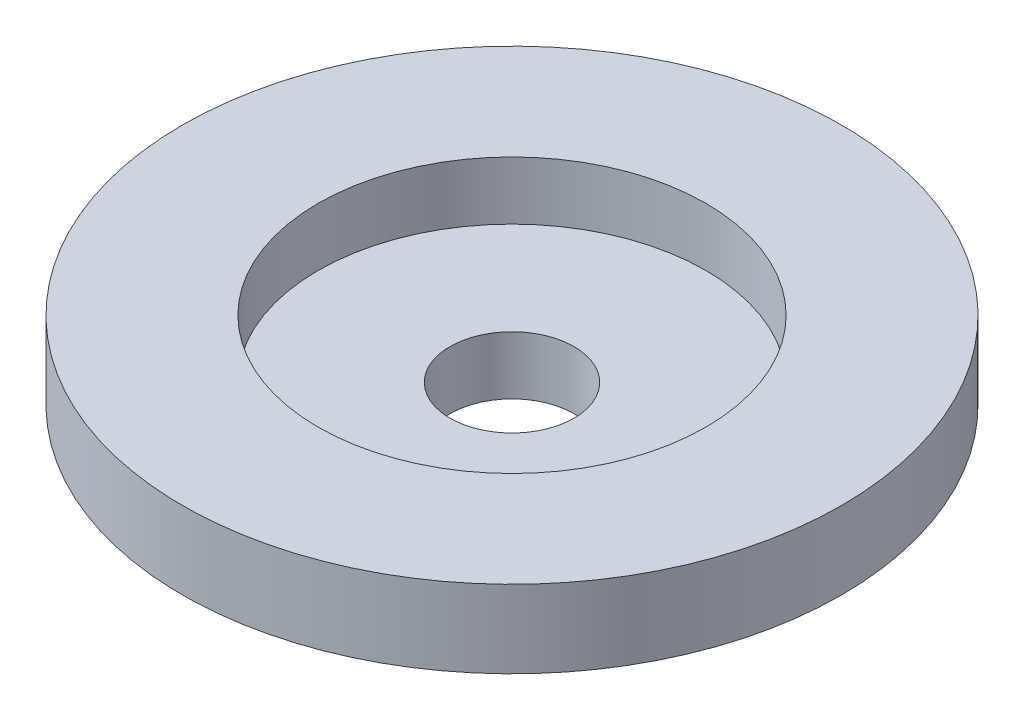
ISO-10303-21;
HEADER;
FILE_DESCRIPTION(('STEP AP214'),'2;1');
FILE_NAME('part.step','',(''),(''),'','','');
FILE_SCHEMA(('AUTOMOTIVE_DESIGN { 1 0 10303 214 1 1 1 1 }'));
ENDSEC;
DATA;
#1=APPLICATION_CONTEXT('core data for automotive mechanical design processes');
#2=APPLICATION_PROTOCOL_DEFINITION('international standard','automotive_design',2000,#1);
#3=PRODUCT_CONTEXT('',#1,'mechanical');
#4=PRODUCT('Part','Part','',(#3));
#5=PRODUCT_RELATED_PRODUCT_CATEGORY('part','',(#4));
#6=PRODUCT_DEFINITION_FORMATION('','',#4);
#7=PRODUCT_DEFINITION_CONTEXT('part definition',#1,'design');
#8=PRODUCT_DEFINITION('design','',#6,#7);
#9=PRODUCT_DEFINITION_SHAPE('','',#8);
#10=(LENGTH_UNIT() NAMED_UNIT(*) SI_UNIT(.MILLI.,.METRE.));
#11=(NAMED_UNIT(*) PLANE_ANGLE_UNIT() SI_UNIT($,.RADIAN.));
#12=(NAMED_UNIT(*) SI_UNIT($,.STERADIAN.) SOLID_ANGLE_UNIT());
#13=UNCERTAINTY_MEASURE_WITH_UNIT(LENGTH_MEASURE(1.E-05),#10,'distance_accuracy_value','');
#14=(GEOMETRIC_REPRESENTATION_CONTEXT(3) GLOBAL_UNCERTAINTY_ASSIGNED_CONTEXT((#13)) GLOBAL_UNIT_ASSIGNED_CONTEXT((#10,
#11,#12)) REPRESENTATION_CONTEXT('',''));
#15=CARTESIAN_POINT('',(0.,0.,0.));
#16=DIRECTION('',(0.,0.,1.));
#17=DIRECTION('',(1.,0.,0.));
#18=AXIS2_PLACEMENT_3D('',#15,#16,#17);
#19=CARTESIAN_POINT('',(3.49148133884313E-12,-1000.,0.));
#20=DIRECTION('',(0.,-1.,0.));
#21=DIRECTION('',(1.,0.,0.));
#22=AXIS2_PLACEMENT_3D('',#19,#20,#21);
#23=CYLINDRICAL_SURFACE('',#22,1.6);
#24=CARTESIAN_POINT('',(0.,1.50000000000006,0.));
#25=DIRECTION('',(0.,-1.,0.));
#26=DIRECTION('',(1.,0.,0.));
#27=AXIS2_PLACEMENT_3D('',#24,#25,#26);
#28=CIRCLE('',#27,1.59999999999999);
#29=CARTESIAN_POINT('',(1.59999999999999,1.50000000000006,0.));
#30=VERTEX_POINT('',#29);
#31=EDGE_CURVE('E59',#30,#30,#28,.T.);
#32=ORIENTED_EDGE('',*,*,#31,.F.);
#33=EDGE_LOOP('',(#32));
#34=FACE_BOUND('',#33,.T.);
#35=CARTESIAN_POINT('',(0.,0.,0.));
#36=DIRECTION('',(0.,-1.,0.));
#37=DIRECTION('',(1.,0.,0.));
#38=AXIS2_PLACEMENT_3D('',#35,#36,#37);
#39=CIRCLE('',#38,1.6);
#40=CARTESIAN_POINT('',(1.6,0.,0.));
#41=VERTEX_POINT('',#40);
#42=EDGE_CURVE('E10',#41,#41,#39,.T.);
#43=ORIENTED_EDGE('',*,*,#42,.T.);
#44=EDGE_LOOP('',(#43));
#45=FACE_BOUND('',#44,.T.);
#46=ADVANCED_FACE('F31',(#34,#45),#23,.F.);
#47=CARTESIAN_POINT('',(-1.6,0.,0.));
#48=DIRECTION('',(0.,1.,0.));
#49=DIRECTION('',(-1.,0.,0.));
#50=AXIS2_PLACEMENT_3D('',#47,#48,#49);
#51=PLANE('',#50);
#52=ORIENTED_EDGE('',*,*,#42,.F.);
#53=EDGE_LOOP('',(#52));
#54=FACE_BOUND('',#53,.T.);
#55=CARTESIAN_POINT('',(0.,0.,0.));
#56=DIRECTION('',(0.,-1.,0.));
#57=DIRECTION('',(1.,0.,0.));
#58=AXIS2_PLACEMENT_3D('',#55,#56,#57);
#59=CIRCLE('',#58,6.5);
#60=CARTESIAN_POINT('',(6.5,0.,0.));
#61=VERTEX_POINT('',#60);
#62=EDGE_CURVE('E37',#61,#61,#59,.T.);
#63=ORIENTED_EDGE('',*,*,#62,.T.);
#64=EDGE_LOOP('',(#63));
#65=FACE_BOUND('',#64,.T.);
#66=ADVANCED_FACE('F66',(#54,#65),#51,.F.);
#67=CARTESIAN_POINT('',(3.49148133884313E-12,-1000.,0.));
#68=DIRECTION('',(0.,-1.,0.));
#69=DIRECTION('',(1.,0.,0.));
#70=AXIS2_PLACEMENT_3D('',#67,#68,#69);
#71=CYLINDRICAL_SURFACE('',#70,6.5);
#72=ORIENTED_EDGE('',*,*,#62,.F.);
#73=EDGE_LOOP('',(#72));
#74=FACE_BOUND('',#73,.T.);
#75=CARTESIAN_POINT('',(0.,0.99999999999989,0.));
#76=DIRECTION('',(0.,-1.,0.));
#77=DIRECTION('',(1.,0.,0.));
#78=AXIS2_PLACEMENT_3D('',#75,#76,#77);
#79=CIRCLE('',#78,6.5);
#80=CARTESIAN_POINT('',(6.49999999999999,0.999999999999913,0.));
#81=VERTEX_POINT('',#80);
#82=EDGE_CURVE('E41',#81,#81,#79,.T.);
#83=ORIENTED_EDGE('',*,*,#82,.T.);
#84=EDGE_LOOP('',(#83));
#85=FACE_BOUND('',#84,.T.);
#86=ADVANCED_FACE('F70',(#74,#85),#71,.T.);
#87=CARTESIAN_POINT('',(-6.5,1.,0.));
#88=DIRECTION('',(0.,1.,0.));
#89=DIRECTION('',(-1.,0.,0.));
#90=AXIS2_PLACEMENT_3D('',#87,#88,#89);
#91=PLANE('',#90);
#92=ORIENTED_EDGE('',*,*,#82,.F.);
#93=EDGE_LOOP('',(#92));
#94=FACE_BOUND('',#93,.T.);
#95=CARTESIAN_POINT('',(0.,0.99999999999989,0.));
#96=DIRECTION('',(0.,-1.,0.));
#97=DIRECTION('',(1.,0.,0.));
#98=AXIS2_PLACEMENT_3D('',#95,#96,#97);
#99=CIRCLE('',#98,8.5);
#100=CARTESIAN_POINT('',(8.49999999999999,0.99999999999992,0.));
#101=VERTEX_POINT('',#100);
#102=EDGE_CURVE('E45',#101,#101,#99,.T.);
#103=ORIENTED_EDGE('',*,*,#102,.T.);
#104=EDGE_LOOP('',(#103));
#105=FACE_BOUND('',#104,.T.);
#106=ADVANCED_FACE('F75',(#94,#105),#91,.F.);
#107=CARTESIAN_POINT('',(3.49148133884313E-12,-1000.,0.));
#108=DIRECTION('',(0.,-1.,0.));
#109=DIRECTION('',(1.,0.,0.));
#110=AXIS2_PLACEMENT_3D('',#107,#108,#109);
#111=CYLINDRICAL_SURFACE('',#110,8.49999999999999);
#112=ORIENTED_EDGE('',*,*,#102,.F.);
#113=EDGE_LOOP('',(#112));
#114=FACE_BOUND('',#113,.T.);
#115=CARTESIAN_POINT('',(0.,2.99999999999989,0.));
#116=DIRECTION('',(0.,-1.,0.));
#117=DIRECTION('',(1.,0.,0.));
#118=AXIS2_PLACEMENT_3D('',#115,#116,#117);
#119=CIRCLE('',#118,8.49999999999999);
#120=CARTESIAN_POINT('',(8.49999999999998,2.99999999999992,0.));
#121=VERTEX_POINT('',#120);
#122=EDGE_CURVE('E50',#121,#121,#119,.T.);
#123=ORIENTED_EDGE('',*,*,#122,.T.);
#124=EDGE_LOOP('',(#123));
#125=FACE_BOUND('',#124,.T.);
#126=ADVANCED_FACE('F81',(#114,#125),#111,.T.);
#127=CARTESIAN_POINT('',(-8.5,2.99999999999999,0.));
#128=DIRECTION('',(0.,-1.,0.));
#129=DIRECTION('',(1.,0.,0.));
#130=AXIS2_PLACEMENT_3D('',#127,#128,#129);
#131=PLANE('',#130);
#132=ORIENTED_EDGE('',*,*,#122,.F.);
#133=EDGE_LOOP('',(#132));
#134=FACE_BOUND('',#133,.T.);
#135=CARTESIAN_POINT('',(0.,2.99999999999989,0.));
#136=DIRECTION('',(0.,-1.,0.));
#137=DIRECTION('',(1.,0.,0.));
#138=AXIS2_PLACEMENT_3D('',#135,#136,#137);
#139=CIRCLE('',#138,4.99999999999999);
#140=CARTESIAN_POINT('',(4.99999999999998,2.99999999999991,0.));
#141=VERTEX_POINT('',#140);
#142=EDGE_CURVE('E53',#141,#141,#139,.T.);
#143=ORIENTED_EDGE('',*,*,#142,.T.);
#144=EDGE_LOOP('',(#143));
#145=FACE_BOUND('',#144,.T.);
#146=ADVANCED_FACE('F85',(#134,#145),#131,.F.);
#147=CARTESIAN_POINT('',(3.49148133884313E-12,-1000.,0.));
#148=DIRECTION('',(0.,-1.,0.));
#149=DIRECTION('',(1.,0.,0.));
#150=AXIS2_PLACEMENT_3D('',#147,#148,#149);
#151=CYLINDRICAL_SURFACE('',#150,4.99999999999999);
#152=ORIENTED_EDGE('',*,*,#142,.F.);
#153=EDGE_LOOP('',(#152));
#154=FACE_BOUND('',#153,.T.);
#155=CARTESIAN_POINT('',(0.,1.50000000000006,0.));
#156=DIRECTION('',(0.,-1.,0.));
#157=DIRECTION('',(1.,0.,0.));
#158=AXIS2_PLACEMENT_3D('',#155,#156,#157);
#159=CIRCLE('',#158,5.);
#160=CARTESIAN_POINT('',(4.99999999999999,1.50000000000007,0.));
#161=VERTEX_POINT('',#160);
#162=EDGE_CURVE('E56',#161,#161,#159,.T.);
#163=ORIENTED_EDGE('',*,*,#162,.T.);
#164=EDGE_LOOP('',(#163));
#165=FACE_BOUND('',#164,.T.);
#166=ADVANCED_FACE('F89',(#154,#165),#151,.F.);
#167=CARTESIAN_POINT('',(-5.,1.49999999999999,0.));
#168=DIRECTION('',(0.,-1.,0.));
#169=DIRECTION('',(1.,0.,0.));
#170=AXIS2_PLACEMENT_3D('',#167,#168,#169);
#171=PLANE('',#170);
#172=ORIENTED_EDGE('',*,*,#162,.F.);
#173=EDGE_LOOP('',(#172));
#174=FACE_BOUND('',#173,.T.);
#175=ORIENTED_EDGE('',*,*,#31,.T.);
#176=EDGE_LOOP('',(#175));
#177=FACE_BOUND('',#176,.T.);
#178=ADVANCED_FACE('F63',(#174,#177),#171,.F.);
#179=CLOSED_SHELL('',(#46,#66,#86,#106,#126,#146,#166,#178));
#180=MANIFOLD_SOLID_BREP('B2',#179);
#181=ADVANCED_BREP_SHAPE_REPRESENTATION('',(#18,#180),#14);
#182=SHAPE_DEFINITION_REPRESENTATION(#9,#181);
ENDSEC;
END-ISO-10303-21;
